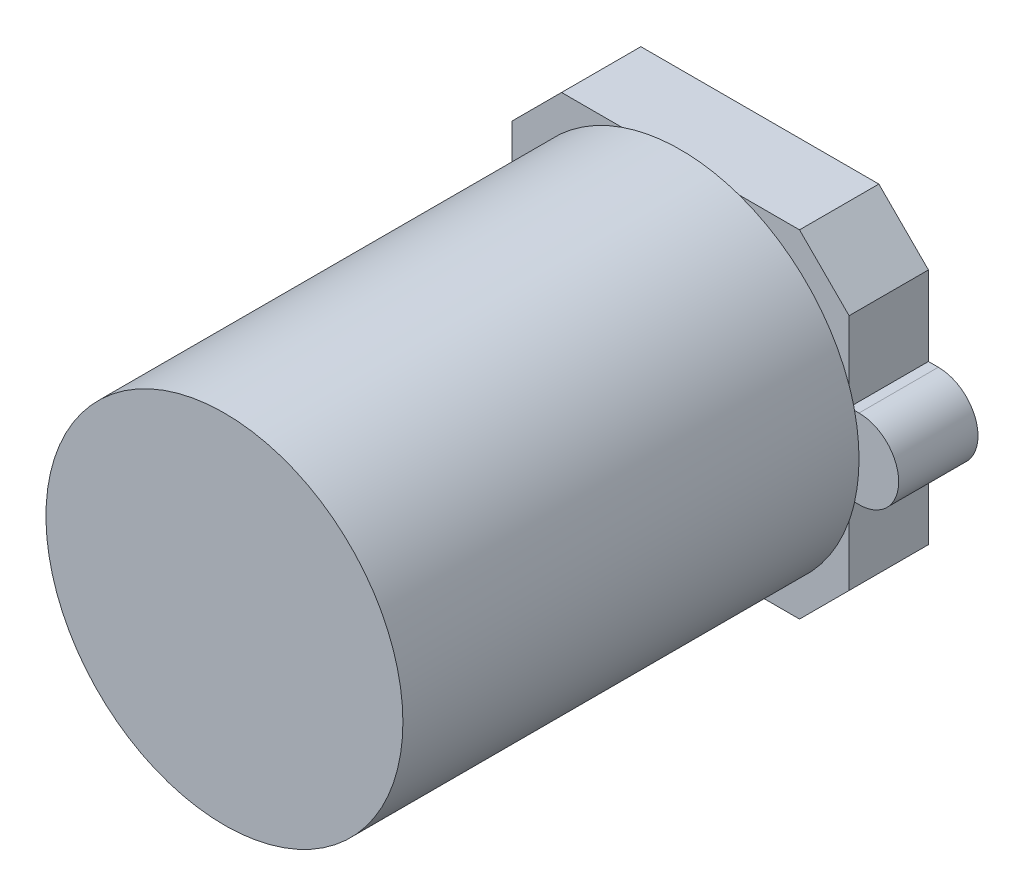
ISO-10303-21;
HEADER;
FILE_DESCRIPTION(('STEP AP214'),'2;1');
FILE_NAME('part.step','',(''),(''),'','','');
FILE_SCHEMA(('AUTOMOTIVE_DESIGN { 1 0 10303 214 1 1 1 1 }'));
ENDSEC;
DATA;
#1=APPLICATION_CONTEXT('core data for automotive mechanical design processes');
#2=APPLICATION_PROTOCOL_DEFINITION('international standard','automotive_design',2000,#1);
#3=PRODUCT_CONTEXT('',#1,'mechanical');
#4=PRODUCT('Part','Part','',(#3));
#5=PRODUCT_RELATED_PRODUCT_CATEGORY('part','',(#4));
#6=PRODUCT_DEFINITION_FORMATION('','',#4);
#7=PRODUCT_DEFINITION_CONTEXT('part definition',#1,'design');
#8=PRODUCT_DEFINITION('design','',#6,#7);
#9=PRODUCT_DEFINITION_SHAPE('','',#8);
#10=(LENGTH_UNIT() NAMED_UNIT(*) SI_UNIT(.MILLI.,.METRE.));
#11=(NAMED_UNIT(*) PLANE_ANGLE_UNIT() SI_UNIT($,.RADIAN.));
#12=(NAMED_UNIT(*) SI_UNIT($,.STERADIAN.) SOLID_ANGLE_UNIT());
#13=UNCERTAINTY_MEASURE_WITH_UNIT(LENGTH_MEASURE(1.E-05),#10,'distance_accuracy_value','');
#14=(GEOMETRIC_REPRESENTATION_CONTEXT(3) GLOBAL_UNCERTAINTY_ASSIGNED_CONTEXT((#13)) GLOBAL_UNIT_ASSIGNED_CONTEXT((#10,
#11,#12)) REPRESENTATION_CONTEXT('',''));
#15=CARTESIAN_POINT('',(0.,0.,0.));
#16=DIRECTION('',(0.,0.,1.));
#17=DIRECTION('',(1.,0.,0.));
#18=AXIS2_PLACEMENT_3D('',#15,#16,#17);
#19=CARTESIAN_POINT('',(0.,0.,4.));
#20=DIRECTION('',(0.,0.,-1.));
#21=DIRECTION('',(-1.,0.,0.));
#22=AXIS2_PLACEMENT_3D('',#19,#20,#21);
#23=PLANE('',#22);
#24=CARTESIAN_POINT('',(0.,0.,4.));
#25=DIRECTION('',(0.,0.,1.));
#26=DIRECTION('',(1.,0.,0.));
#27=AXIS2_PLACEMENT_3D('',#24,#25,#26);
#28=CIRCLE('',#27,9.);
#29=CARTESIAN_POINT('',(8.5,2.95803989154981,4.));
#30=VERTEX_POINT('',#29);
#31=CARTESIAN_POINT('',(2.95803989154981,8.5,4.));
#32=VERTEX_POINT('',#31);
#33=EDGE_CURVE('E11',#30,#32,#28,.T.);
#34=ORIENTED_EDGE('',*,*,#33,.F.);
#35=DIRECTION('',(0.,1.,0.));
#36=VECTOR('',#35,1.);
#37=CARTESIAN_POINT('',(8.5,-8.5,4.));
#38=LINE('',#37,#36);
#39=CARTESIAN_POINT('',(8.5,5.99999999999999,4.));
#40=VERTEX_POINT('',#39);
#41=EDGE_CURVE('E426',#30,#40,#38,.T.);
#42=ORIENTED_EDGE('',*,*,#41,.T.);
#43=DIRECTION('',(0.707106781186546,-0.707106781186549,0.));
#44=VECTOR('',#43,1.);
#45=CARTESIAN_POINT('',(6.,8.5,4.));
#46=LINE('',#45,#44);
#47=CARTESIAN_POINT('',(6.,8.5,4.));
#48=VERTEX_POINT('',#47);
#49=EDGE_CURVE('E304',#40,#48,#46,.F.);
#50=ORIENTED_EDGE('',*,*,#49,.T.);
#51=DIRECTION('',(-1.,0.,0.));
#52=VECTOR('',#51,1.);
#53=CARTESIAN_POINT('',(-8.5,8.5,4.));
#54=LINE('',#53,#52);
#55=EDGE_CURVE('E347',#48,#32,#54,.T.);
#56=ORIENTED_EDGE('',*,*,#55,.T.);
#57=EDGE_LOOP('',(#34,#42,#50,#56));
#58=FACE_BOUND('',#57,.T.);
#59=ADVANCED_FACE('F32',(#58),#23,.F.);
#60=CARTESIAN_POINT('',(-2.95803989154981,8.5,4.));
#61=VERTEX_POINT('',#60);
#62=CARTESIAN_POINT('',(-8.5,2.9580398915498,4.));
#63=VERTEX_POINT('',#62);
#64=EDGE_CURVE('E42',#61,#63,#28,.T.);
#65=ORIENTED_EDGE('',*,*,#64,.F.);
#66=CARTESIAN_POINT('',(-6.,8.5,4.));
#67=VERTEX_POINT('',#66);
#68=EDGE_CURVE('E354',#61,#67,#54,.T.);
#69=ORIENTED_EDGE('',*,*,#68,.T.);
#70=DIRECTION('',(0.707106781186549,0.707106781186546,0.));
#71=VECTOR('',#70,1.);
#72=CARTESIAN_POINT('',(-8.5,6.,4.));
#73=LINE('',#72,#71);
#74=CARTESIAN_POINT('',(-8.5,6.,4.));
#75=VERTEX_POINT('',#74);
#76=EDGE_CURVE('E310',#67,#75,#73,.F.);
#77=ORIENTED_EDGE('',*,*,#76,.T.);
#78=DIRECTION('',(0.,-1.,0.));
#79=VECTOR('',#78,1.);
#80=CARTESIAN_POINT('',(-8.5,-8.5,4.));
#81=LINE('',#80,#79);
#82=EDGE_CURVE('E338',#75,#63,#81,.T.);
#83=ORIENTED_EDGE('',*,*,#82,.T.);
#84=EDGE_LOOP('',(#65,#69,#77,#83));
#85=FACE_BOUND('',#84,.T.);
#86=ADVANCED_FACE('F498',(#85),#23,.F.);
#87=CARTESIAN_POINT('',(-8.77496438739212,2.,4.));
#88=VERTEX_POINT('',#87);
#89=CARTESIAN_POINT('',(-8.77496438739212,-2.,4.));
#90=VERTEX_POINT('',#89);
#91=EDGE_CURVE('E237',#88,#90,#28,.T.);
#92=ORIENTED_EDGE('',*,*,#91,.F.);
#93=DIRECTION('',(1.,0.,0.));
#94=VECTOR('',#93,1.);
#95=CARTESIAN_POINT('',(-8.5,2.,4.));
#96=LINE('',#95,#94);
#97=CARTESIAN_POINT('',(-9.,2.,4.));
#98=VERTEX_POINT('',#97);
#99=EDGE_CURVE('E247',#98,#88,#96,.T.);
#100=ORIENTED_EDGE('',*,*,#99,.F.);
#101=CARTESIAN_POINT('',(-9.,0.,4.));
#102=DIRECTION('',(0.,0.,-1.));
#103=DIRECTION('',(-1.,0.,0.));
#104=AXIS2_PLACEMENT_3D('',#101,#102,#103);
#105=CIRCLE('',#104,2.);
#106=CARTESIAN_POINT('',(-9.,-2.,4.));
#107=VERTEX_POINT('',#106);
#108=EDGE_CURVE('E248',#107,#98,#105,.T.);
#109=ORIENTED_EDGE('',*,*,#108,.F.);
#110=DIRECTION('',(-1.,0.,0.));
#111=VECTOR('',#110,1.);
#112=CARTESIAN_POINT('',(-9.,-2.,4.));
#113=LINE('',#112,#111);
#114=EDGE_CURVE('E258',#90,#107,#113,.T.);
#115=ORIENTED_EDGE('',*,*,#114,.F.);
#116=EDGE_LOOP('',(#92,#100,#109,#115));
#117=FACE_BOUND('',#116,.T.);
#118=ADVANCED_FACE('F503',(#117),#23,.F.);
#119=CARTESIAN_POINT('',(-8.5,-2.9580398915498,4.));
#120=VERTEX_POINT('',#119);
#121=CARTESIAN_POINT('',(-2.9580398915498,-8.5,4.));
#122=VERTEX_POINT('',#121);
#123=EDGE_CURVE('E488',#120,#122,#28,.T.);
#124=ORIENTED_EDGE('',*,*,#123,.F.);
#125=CARTESIAN_POINT('',(-8.5,-6.,4.));
#126=VERTEX_POINT('',#125);
#127=EDGE_CURVE('E36',#120,#126,#81,.T.);
#128=ORIENTED_EDGE('',*,*,#127,.T.);
#129=DIRECTION('',(-0.707106781186546,0.707106781186549,0.));
#130=VECTOR('',#129,1.);
#131=CARTESIAN_POINT('',(-6.00000000000001,-8.5,4.));
#132=LINE('',#131,#130);
#133=CARTESIAN_POINT('',(-6.00000000000001,-8.5,4.));
#134=VERTEX_POINT('',#133);
#135=EDGE_CURVE('E308',#126,#134,#132,.F.);
#136=ORIENTED_EDGE('',*,*,#135,.T.);
#137=DIRECTION('',(1.,0.,0.));
#138=VECTOR('',#137,1.);
#139=CARTESIAN_POINT('',(-8.5,-8.5,4.));
#140=LINE('',#139,#138);
#141=EDGE_CURVE('E277',#134,#122,#140,.T.);
#142=ORIENTED_EDGE('',*,*,#141,.T.);
#143=EDGE_LOOP('',(#124,#128,#136,#142));
#144=FACE_BOUND('',#143,.T.);
#145=ADVANCED_FACE('F487',(#144),#23,.F.);
#146=CARTESIAN_POINT('',(2.9580398915498,-8.5,4.));
#147=VERTEX_POINT('',#146);
#148=CARTESIAN_POINT('',(8.5,-2.95803989154981,4.));
#149=VERTEX_POINT('',#148);
#150=EDGE_CURVE('E51',#147,#149,#28,.T.);
#151=ORIENTED_EDGE('',*,*,#150,.F.);
#152=CARTESIAN_POINT('',(5.99999999999999,-8.5,4.));
#153=VERTEX_POINT('',#152);
#154=EDGE_CURVE('E336',#147,#153,#140,.T.);
#155=ORIENTED_EDGE('',*,*,#154,.T.);
#156=DIRECTION('',(-0.707106781186549,-0.707106781186546,0.));
#157=VECTOR('',#156,1.);
#158=CARTESIAN_POINT('',(8.5,-6.00000000000001,4.));
#159=LINE('',#158,#157);
#160=CARTESIAN_POINT('',(8.5,-6.00000000000001,4.));
#161=VERTEX_POINT('',#160);
#162=EDGE_CURVE('E306',#153,#161,#159,.F.);
#163=ORIENTED_EDGE('',*,*,#162,.T.);
#164=EDGE_CURVE('E364',#161,#149,#38,.T.);
#165=ORIENTED_EDGE('',*,*,#164,.T.);
#166=EDGE_LOOP('',(#151,#155,#163,#165));
#167=FACE_BOUND('',#166,.T.);
#168=ADVANCED_FACE('F428',(#167),#23,.F.);
#169=CARTESIAN_POINT('',(8.77496438739212,-2.,4.));
#170=VERTEX_POINT('',#169);
#171=CARTESIAN_POINT('',(8.77496438739212,2.,4.));
#172=VERTEX_POINT('',#171);
#173=EDGE_CURVE('E190',#170,#172,#28,.T.);
#174=ORIENTED_EDGE('',*,*,#173,.F.);
#175=DIRECTION('',(1.,0.,0.));
#176=VECTOR('',#175,1.);
#177=CARTESIAN_POINT('',(9.,-2.,4.));
#178=LINE('',#177,#176);
#179=CARTESIAN_POINT('',(9.,-2.,4.));
#180=VERTEX_POINT('',#179);
#181=EDGE_CURVE('E372',#170,#180,#178,.T.);
#182=ORIENTED_EDGE('',*,*,#181,.T.);
#183=CARTESIAN_POINT('',(9.,0.,4.));
#184=DIRECTION('',(0.,0.,-1.));
#185=DIRECTION('',(-1.,0.,0.));
#186=AXIS2_PLACEMENT_3D('',#183,#184,#185);
#187=CIRCLE('',#186,2.);
#188=CARTESIAN_POINT('',(9.,2.,4.));
#189=VERTEX_POINT('',#188);
#190=EDGE_CURVE('E193',#180,#189,#187,.F.);
#191=ORIENTED_EDGE('',*,*,#190,.T.);
#192=DIRECTION('',(-1.,0.,0.));
#193=VECTOR('',#192,1.);
#194=CARTESIAN_POINT('',(8.5,2.,4.));
#195=LINE('',#194,#193);
#196=EDGE_CURVE('E186',#189,#172,#195,.T.);
#197=ORIENTED_EDGE('',*,*,#196,.T.);
#198=EDGE_LOOP('',(#174,#182,#191,#197));
#199=FACE_BOUND('',#198,.T.);
#200=ADVANCED_FACE('F188',(#199),#23,.F.);
#201=CARTESIAN_POINT('',(8.5,-8.5,4.));
#202=DIRECTION('',(-1.,0.,0.));
#203=DIRECTION('',(0.,0.,1.));
#204=AXIS2_PLACEMENT_3D('',#201,#202,#203);
#205=PLANE('',#204);
#206=DIRECTION('',(0.,0.,-1.));
#207=VECTOR('',#206,1.);
#208=CARTESIAN_POINT('',(8.5,-2.,8.7169905660283));
#209=LINE('',#208,#207);
#210=CARTESIAN_POINT('',(8.5,-2.,4.));
#211=VERTEX_POINT('',#210);
#212=CARTESIAN_POINT('',(8.5,-2.,0.));
#213=VERTEX_POINT('',#212);
#214=EDGE_CURVE('E392',#211,#213,#209,.T.);
#215=ORIENTED_EDGE('',*,*,#214,.F.);
#216=EDGE_CURVE('E366',#149,#211,#38,.T.);
#217=ORIENTED_EDGE('',*,*,#216,.F.);
#218=ORIENTED_EDGE('',*,*,#164,.F.);
#219=DIRECTION('',(0.,0.,-1.));
#220=VECTOR('',#219,1.);
#221=CARTESIAN_POINT('',(8.5,-6.00000000000001,4.));
#222=LINE('',#221,#220);
#223=CARTESIAN_POINT('',(8.5,-6.00000000000001,0.));
#224=VERTEX_POINT('',#223);
#225=EDGE_CURVE('E315',#161,#224,#222,.T.);
#226=ORIENTED_EDGE('',*,*,#225,.T.);
#227=DIRECTION('',(0.,1.,0.));
#228=VECTOR('',#227,1.);
#229=CARTESIAN_POINT('',(8.5,-8.5,0.));
#230=LINE('',#229,#228);
#231=EDGE_CURVE('E269',#224,#213,#230,.T.);
#232=ORIENTED_EDGE('',*,*,#231,.T.);
#233=EDGE_LOOP('',(#215,#217,#218,#226,#232));
#234=FACE_BOUND('',#233,.T.);
#235=ADVANCED_FACE('F416',(#234),#205,.F.);
#236=CARTESIAN_POINT('',(-8.5,-8.5,4.));
#237=DIRECTION('',(1.,0.,0.));
#238=DIRECTION('',(0.,0.,-1.));
#239=AXIS2_PLACEMENT_3D('',#236,#237,#238);
#240=PLANE('',#239);
#241=DIRECTION('',(0.,0.,-1.));
#242=VECTOR('',#241,1.);
#243=CARTESIAN_POINT('',(-8.5,2.,8.7169905660283));
#244=LINE('',#243,#242);
#245=CARTESIAN_POINT('',(-8.5,2.,4.));
#246=VERTEX_POINT('',#245);
#247=CARTESIAN_POINT('',(-8.5,2.,0.));
#248=VERTEX_POINT('',#247);
#249=EDGE_CURVE('E450',#246,#248,#244,.T.);
#250=ORIENTED_EDGE('',*,*,#249,.F.);
#251=EDGE_CURVE('E242',#63,#246,#81,.T.);
#252=ORIENTED_EDGE('',*,*,#251,.F.);
#253=ORIENTED_EDGE('',*,*,#82,.F.);
#254=DIRECTION('',(0.,0.,-1.));
#255=VECTOR('',#254,1.);
#256=CARTESIAN_POINT('',(-8.5,6.,4.));
#257=LINE('',#256,#255);
#258=CARTESIAN_POINT('',(-8.5,6.00000000000001,0.));
#259=VERTEX_POINT('',#258);
#260=EDGE_CURVE('E295',#75,#259,#257,.T.);
#261=ORIENTED_EDGE('',*,*,#260,.T.);
#262=DIRECTION('',(0.,-1.,0.));
#263=VECTOR('',#262,1.);
#264=CARTESIAN_POINT('',(-8.5,-8.5,0.));
#265=LINE('',#264,#263);
#266=EDGE_CURVE('E290',#259,#248,#265,.T.);
#267=ORIENTED_EDGE('',*,*,#266,.T.);
#268=EDGE_LOOP('',(#250,#252,#253,#261,#267));
#269=FACE_BOUND('',#268,.T.);
#270=ADVANCED_FACE('F449',(#269),#240,.F.);
#271=CARTESIAN_POINT('',(8.5,2.,4.));
#272=VERTEX_POINT('',#271);
#273=EDGE_CURVE('E218',#272,#30,#38,.T.);
#274=ORIENTED_EDGE('',*,*,#273,.F.);
#275=DIRECTION('',(0.,0.,-1.));
#276=VECTOR('',#275,1.);
#277=CARTESIAN_POINT('',(8.5,2.,8.7169905660283));
#278=LINE('',#277,#276);
#279=CARTESIAN_POINT('',(8.5,2.,0.));
#280=VERTEX_POINT('',#279);
#281=EDGE_CURVE('E203',#272,#280,#278,.T.);
#282=ORIENTED_EDGE('',*,*,#281,.T.);
#283=CARTESIAN_POINT('',(8.5,5.99999999999999,0.));
#284=VERTEX_POINT('',#283);
#285=EDGE_CURVE('E250',#280,#284,#230,.T.);
#286=ORIENTED_EDGE('',*,*,#285,.T.);
#287=DIRECTION('',(0.,0.,1.));
#288=VECTOR('',#287,1.);
#289=CARTESIAN_POINT('',(8.5,5.99999999999999,4.));
#290=LINE('',#289,#288);
#291=EDGE_CURVE('E312',#284,#40,#290,.T.);
#292=ORIENTED_EDGE('',*,*,#291,.T.);
#293=ORIENTED_EDGE('',*,*,#41,.F.);
#294=EDGE_LOOP('',(#274,#282,#286,#292,#293));
#295=FACE_BOUND('',#294,.T.);
#296=ADVANCED_FACE('F437',(#295),#205,.F.);
#297=CARTESIAN_POINT('',(-8.5,8.5,4.));
#298=DIRECTION('',(0.,-1.,0.));
#299=DIRECTION('',(0.,0.,-1.));
#300=AXIS2_PLACEMENT_3D('',#297,#298,#299);
#301=PLANE('',#300);
#302=ORIENTED_EDGE('',*,*,#55,.F.);
#303=DIRECTION('',(0.,0.,-1.));
#304=VECTOR('',#303,1.);
#305=CARTESIAN_POINT('',(6.,8.5,4.));
#306=LINE('',#305,#304);
#307=CARTESIAN_POINT('',(6.00000000000001,8.5,0.));
#308=VERTEX_POINT('',#307);
#309=EDGE_CURVE('E328',#48,#308,#306,.T.);
#310=ORIENTED_EDGE('',*,*,#309,.T.);
#311=DIRECTION('',(-1.,0.,0.));
#312=VECTOR('',#311,1.);
#313=CARTESIAN_POINT('',(-8.5,8.5,0.));
#314=LINE('',#313,#312);
#315=CARTESIAN_POINT('',(-6.,8.5,0.));
#316=VERTEX_POINT('',#315);
#317=EDGE_CURVE('E272',#308,#316,#314,.T.);
#318=ORIENTED_EDGE('',*,*,#317,.T.);
#319=DIRECTION('',(0.,0.,1.));
#320=VECTOR('',#319,1.);
#321=CARTESIAN_POINT('',(-6.,8.5,4.));
#322=LINE('',#321,#320);
#323=EDGE_CURVE('E330',#316,#67,#322,.T.);
#324=ORIENTED_EDGE('',*,*,#323,.T.);
#325=ORIENTED_EDGE('',*,*,#68,.F.);
#326=EDGE_CURVE('E353',#32,#61,#54,.T.);
#327=ORIENTED_EDGE('',*,*,#326,.F.);
#328=EDGE_LOOP('',(#302,#310,#318,#324,#325,#327));
#329=FACE_BOUND('',#328,.T.);
#330=ADVANCED_FACE('F443',(#329),#301,.F.);
#331=CARTESIAN_POINT('',(-8.5,-2.,4.));
#332=VERTEX_POINT('',#331);
#333=EDGE_CURVE('E342',#332,#120,#81,.T.);
#334=ORIENTED_EDGE('',*,*,#333,.F.);
#335=DIRECTION('',(0.,0.,-1.));
#336=VECTOR('',#335,1.);
#337=CARTESIAN_POINT('',(-8.5,-2.,8.7169905660283));
#338=LINE('',#337,#336);
#339=CARTESIAN_POINT('',(-8.5,-2.,0.));
#340=VERTEX_POINT('',#339);
#341=EDGE_CURVE('E458',#332,#340,#338,.T.);
#342=ORIENTED_EDGE('',*,*,#341,.T.);
#343=CARTESIAN_POINT('',(-8.5,-6.,0.));
#344=VERTEX_POINT('',#343);
#345=EDGE_CURVE('E281',#340,#344,#265,.T.);
#346=ORIENTED_EDGE('',*,*,#345,.T.);
#347=DIRECTION('',(0.,0.,1.));
#348=VECTOR('',#347,1.);
#349=CARTESIAN_POINT('',(-8.5,-6.,4.));
#350=LINE('',#349,#348);
#351=EDGE_CURVE('E216',#344,#126,#350,.T.);
#352=ORIENTED_EDGE('',*,*,#351,.T.);
#353=ORIENTED_EDGE('',*,*,#127,.F.);
#354=EDGE_LOOP('',(#334,#342,#346,#352,#353));
#355=FACE_BOUND('',#354,.T.);
#356=ADVANCED_FACE('F480',(#355),#240,.F.);
#357=CARTESIAN_POINT('',(-8.5,-8.5,4.));
#358=DIRECTION('',(0.,1.,0.));
#359=DIRECTION('',(0.,0.,1.));
#360=AXIS2_PLACEMENT_3D('',#357,#358,#359);
#361=PLANE('',#360);
#362=DIRECTION('',(1.,0.,0.));
#363=VECTOR('',#362,1.);
#364=CARTESIAN_POINT('',(-8.5,-8.5,0.));
#365=LINE('',#364,#363);
#366=CARTESIAN_POINT('',(-6.00000000000001,-8.5,0.));
#367=VERTEX_POINT('',#366);
#368=CARTESIAN_POINT('',(5.99999999999999,-8.5,0.));
#369=VERTEX_POINT('',#368);
#370=EDGE_CURVE('E284',#367,#369,#365,.T.);
#371=ORIENTED_EDGE('',*,*,#370,.T.);
#372=DIRECTION('',(0.,0.,1.));
#373=VECTOR('',#372,1.);
#374=CARTESIAN_POINT('',(5.99999999999999,-8.5,4.));
#375=LINE('',#374,#373);
#376=EDGE_CURVE('E298',#369,#153,#375,.T.);
#377=ORIENTED_EDGE('',*,*,#376,.T.);
#378=ORIENTED_EDGE('',*,*,#154,.F.);
#379=EDGE_CURVE('E58',#122,#147,#140,.T.);
#380=ORIENTED_EDGE('',*,*,#379,.F.);
#381=ORIENTED_EDGE('',*,*,#141,.F.);
#382=DIRECTION('',(0.,0.,-1.));
#383=VECTOR('',#382,1.);
#384=CARTESIAN_POINT('',(-6.00000000000001,-8.5,4.));
#385=LINE('',#384,#383);
#386=EDGE_CURVE('E301',#134,#367,#385,.T.);
#387=ORIENTED_EDGE('',*,*,#386,.T.);
#388=EDGE_LOOP('',(#371,#377,#378,#380,#381,#387));
#389=FACE_BOUND('',#388,.T.);
#390=ADVANCED_FACE('F423',(#389),#361,.F.);
#391=CARTESIAN_POINT('',(0.,0.,0.));
#392=DIRECTION('',(0.,0.,-1.));
#393=DIRECTION('',(-1.,0.,0.));
#394=AXIS2_PLACEMENT_3D('',#391,#392,#393);
#395=PLANE('',#394);
#396=ORIENTED_EDGE('',*,*,#317,.F.);
#397=DIRECTION('',(-0.707106781186546,0.707106781186549,0.));
#398=VECTOR('',#397,1.);
#399=CARTESIAN_POINT('',(7.25000000000001,7.24999999999998,0.));
#400=LINE('',#399,#398);
#401=EDGE_CURVE('E318',#308,#284,#400,.F.);
#402=ORIENTED_EDGE('',*,*,#401,.T.);
#403=ORIENTED_EDGE('',*,*,#285,.F.);
#404=DIRECTION('',(1.,0.,0.));
#405=VECTOR('',#404,1.);
#406=CARTESIAN_POINT('',(8.5,2.,0.));
#407=LINE('',#406,#405);
#408=CARTESIAN_POINT('',(9.,2.,0.));
#409=VERTEX_POINT('',#408);
#410=EDGE_CURVE('E384',#280,#409,#407,.T.);
#411=ORIENTED_EDGE('',*,*,#410,.T.);
#412=CARTESIAN_POINT('',(9.,0.,0.));
#413=DIRECTION('',(0.,0.,-1.));
#414=DIRECTION('',(-1.,0.,0.));
#415=AXIS2_PLACEMENT_3D('',#412,#413,#414);
#416=CIRCLE('',#415,2.);
#417=CARTESIAN_POINT('',(9.,-2.,0.));
#418=VERTEX_POINT('',#417);
#419=EDGE_CURVE('E388',#409,#418,#416,.T.);
#420=ORIENTED_EDGE('',*,*,#419,.T.);
#421=DIRECTION('',(-1.,0.,0.));
#422=VECTOR('',#421,1.);
#423=CARTESIAN_POINT('',(9.,-2.,0.));
#424=LINE('',#423,#422);
#425=EDGE_CURVE('E221',#418,#213,#424,.T.);
#426=ORIENTED_EDGE('',*,*,#425,.T.);
#427=ORIENTED_EDGE('',*,*,#231,.F.);
#428=DIRECTION('',(0.707106781186549,0.707106781186546,0.));
#429=VECTOR('',#428,1.);
#430=CARTESIAN_POINT('',(7.24999999999998,-7.25000000000002,0.));
#431=LINE('',#430,#429);
#432=EDGE_CURVE('E321',#224,#369,#431,.F.);
#433=ORIENTED_EDGE('',*,*,#432,.T.);
#434=ORIENTED_EDGE('',*,*,#370,.F.);
#435=DIRECTION('',(0.707106781186546,-0.707106781186549,0.));
#436=VECTOR('',#435,1.);
#437=CARTESIAN_POINT('',(-7.25000000000002,-7.24999999999999,0.));
#438=LINE('',#437,#436);
#439=EDGE_CURVE('E323',#367,#344,#438,.F.);
#440=ORIENTED_EDGE('',*,*,#439,.T.);
#441=ORIENTED_EDGE('',*,*,#345,.F.);
#442=DIRECTION('',(1.,0.,0.));
#443=VECTOR('',#442,1.);
#444=CARTESIAN_POINT('',(-9.,-2.,0.));
#445=LINE('',#444,#443);
#446=CARTESIAN_POINT('',(-9.,-2.,0.));
#447=VERTEX_POINT('',#446);
#448=EDGE_CURVE('E462',#447,#340,#445,.T.);
#449=ORIENTED_EDGE('',*,*,#448,.F.);
#450=CARTESIAN_POINT('',(-9.,0.,0.));
#451=DIRECTION('',(0.,0.,1.));
#452=DIRECTION('',(1.,0.,0.));
#453=AXIS2_PLACEMENT_3D('',#450,#451,#452);
#454=CIRCLE('',#453,2.);
#455=CARTESIAN_POINT('',(-9.,2.,0.));
#456=VERTEX_POINT('',#455);
#457=EDGE_CURVE('E266',#456,#447,#454,.T.);
#458=ORIENTED_EDGE('',*,*,#457,.F.);
#459=DIRECTION('',(-1.,0.,0.));
#460=VECTOR('',#459,1.);
#461=CARTESIAN_POINT('',(-8.5,2.,0.));
#462=LINE('',#461,#460);
#463=EDGE_CURVE('E196',#248,#456,#462,.T.);
#464=ORIENTED_EDGE('',*,*,#463,.F.);
#465=ORIENTED_EDGE('',*,*,#266,.F.);
#466=DIRECTION('',(-0.707106781186549,-0.707106781186546,0.));
#467=VECTOR('',#466,1.);
#468=CARTESIAN_POINT('',(-7.24999999999999,7.25000000000002,0.));
#469=LINE('',#468,#467);
#470=EDGE_CURVE('E326',#259,#316,#469,.F.);
#471=ORIENTED_EDGE('',*,*,#470,.T.);
#472=EDGE_LOOP('',(#396,#402,#403,#411,#420,#426,#427,#433,#434,#440,#441,#449,#458,#464,#465,#471));
#473=FACE_BOUND('',#472,.T.);
#474=ADVANCED_FACE('F407',(#473),#395,.T.);
#475=CARTESIAN_POINT('',(6.,8.5,4.));
#476=DIRECTION('',(-0.707106781186549,-0.707106781186546,0.));
#477=DIRECTION('',(0.,0.,-1.));
#478=AXIS2_PLACEMENT_3D('',#475,#476,#477);
#479=PLANE('',#478);
#480=ORIENTED_EDGE('',*,*,#49,.F.);
#481=ORIENTED_EDGE('',*,*,#291,.F.);
#482=ORIENTED_EDGE('',*,*,#401,.F.);
#483=ORIENTED_EDGE('',*,*,#309,.F.);
#484=EDGE_LOOP('',(#480,#481,#482,#483));
#485=FACE_BOUND('',#484,.T.);
#486=ADVANCED_FACE('F442',(#485),#479,.F.);
#487=CARTESIAN_POINT('',(8.5,-6.00000000000001,4.));
#488=DIRECTION('',(-0.707106781186546,0.707106781186549,0.));
#489=DIRECTION('',(0.,0.,-1.));
#490=AXIS2_PLACEMENT_3D('',#487,#488,#489);
#491=PLANE('',#490);
#492=ORIENTED_EDGE('',*,*,#162,.F.);
#493=ORIENTED_EDGE('',*,*,#376,.F.);
#494=ORIENTED_EDGE('',*,*,#432,.F.);
#495=ORIENTED_EDGE('',*,*,#225,.F.);
#496=EDGE_LOOP('',(#492,#493,#494,#495));
#497=FACE_BOUND('',#496,.T.);
#498=ADVANCED_FACE('F427',(#497),#491,.F.);
#499=CARTESIAN_POINT('',(-6.00000000000001,-8.5,4.));
#500=DIRECTION('',(0.707106781186549,0.707106781186546,0.));
#501=DIRECTION('',(0.,0.,-1.));
#502=AXIS2_PLACEMENT_3D('',#499,#500,#501);
#503=PLANE('',#502);
#504=ORIENTED_EDGE('',*,*,#135,.F.);
#505=ORIENTED_EDGE('',*,*,#351,.F.);
#506=ORIENTED_EDGE('',*,*,#439,.F.);
#507=ORIENTED_EDGE('',*,*,#386,.F.);
#508=EDGE_LOOP('',(#504,#505,#506,#507));
#509=FACE_BOUND('',#508,.T.);
#510=ADVANCED_FACE('F490',(#509),#503,.F.);
#511=CARTESIAN_POINT('',(-8.5,6.,4.));
#512=DIRECTION('',(0.707106781186546,-0.707106781186549,0.));
#513=DIRECTION('',(0.,0.,-1.));
#514=AXIS2_PLACEMENT_3D('',#511,#512,#513);
#515=PLANE('',#514);
#516=ORIENTED_EDGE('',*,*,#76,.F.);
#517=ORIENTED_EDGE('',*,*,#323,.F.);
#518=ORIENTED_EDGE('',*,*,#470,.F.);
#519=ORIENTED_EDGE('',*,*,#260,.F.);
#520=EDGE_LOOP('',(#516,#517,#518,#519));
#521=FACE_BOUND('',#520,.T.);
#522=ADVANCED_FACE('F34',(#521),#515,.F.);
#523=CARTESIAN_POINT('',(-9.,-2.,8.7169905660283));
#524=DIRECTION('',(0.,1.,0.));
#525=DIRECTION('',(-1.,0.,0.));
#526=AXIS2_PLACEMENT_3D('',#523,#524,#525);
#527=PLANE('',#526);
#528=ORIENTED_EDGE('',*,*,#341,.F.);
#529=EDGE_CURVE('E253',#332,#90,#113,.T.);
#530=ORIENTED_EDGE('',*,*,#529,.T.);
#531=ORIENTED_EDGE('',*,*,#114,.T.);
#532=DIRECTION('',(0.,0.,-1.));
#533=VECTOR('',#532,1.);
#534=CARTESIAN_POINT('',(-9.,-2.,8.7169905660283));
#535=LINE('',#534,#533);
#536=EDGE_CURVE('E452',#107,#447,#535,.T.);
#537=ORIENTED_EDGE('',*,*,#536,.T.);
#538=ORIENTED_EDGE('',*,*,#448,.T.);
#539=EDGE_LOOP('',(#528,#530,#531,#537,#538));
#540=FACE_BOUND('',#539,.T.);
#541=ADVANCED_FACE('F469',(#540),#527,.F.);
#542=CARTESIAN_POINT('',(-9.,0.,8.7169905660283));
#543=DIRECTION('',(0.,0.,-1.));
#544=DIRECTION('',(-1.,0.,0.));
#545=AXIS2_PLACEMENT_3D('',#542,#543,#544);
#546=CYLINDRICAL_SURFACE('',#545,2.);
#547=ORIENTED_EDGE('',*,*,#536,.F.);
#548=ORIENTED_EDGE('',*,*,#108,.T.);
#549=DIRECTION('',(0.,0.,-1.));
#550=VECTOR('',#549,1.);
#551=CARTESIAN_POINT('',(-9.,2.,8.7169905660283));
#552=LINE('',#551,#550);
#553=EDGE_CURVE('E451',#98,#456,#552,.T.);
#554=ORIENTED_EDGE('',*,*,#553,.T.);
#555=ORIENTED_EDGE('',*,*,#457,.T.);
#556=EDGE_LOOP('',(#547,#548,#554,#555));
#557=FACE_BOUND('',#556,.T.);
#558=ADVANCED_FACE('F474',(#557),#546,.T.);
#559=CARTESIAN_POINT('',(-8.5,2.,8.7169905660283));
#560=DIRECTION('',(0.,-1.,0.));
#561=DIRECTION('',(0.,0.,-1.));
#562=AXIS2_PLACEMENT_3D('',#559,#560,#561);
#563=PLANE('',#562);
#564=ORIENTED_EDGE('',*,*,#553,.F.);
#565=ORIENTED_EDGE('',*,*,#99,.T.);
#566=EDGE_CURVE('E243',#88,#246,#96,.T.);
#567=ORIENTED_EDGE('',*,*,#566,.T.);
#568=ORIENTED_EDGE('',*,*,#249,.T.);
#569=ORIENTED_EDGE('',*,*,#463,.T.);
#570=EDGE_LOOP('',(#564,#565,#567,#568,#569));
#571=FACE_BOUND('',#570,.T.);
#572=ADVANCED_FACE('F521',(#571),#563,.F.);
#573=CARTESIAN_POINT('',(9.,-2.,8.7169905660283));
#574=DIRECTION('',(0.,-1.,0.));
#575=DIRECTION('',(1.,0.,0.));
#576=AXIS2_PLACEMENT_3D('',#573,#574,#575);
#577=PLANE('',#576);
#578=EDGE_CURVE('E207',#211,#170,#178,.T.);
#579=ORIENTED_EDGE('',*,*,#578,.F.);
#580=ORIENTED_EDGE('',*,*,#214,.T.);
#581=ORIENTED_EDGE('',*,*,#425,.F.);
#582=DIRECTION('',(0.,0.,-1.));
#583=VECTOR('',#582,1.);
#584=CARTESIAN_POINT('',(9.,-2.,8.7169905660283));
#585=LINE('',#584,#583);
#586=EDGE_CURVE('E390',#180,#418,#585,.T.);
#587=ORIENTED_EDGE('',*,*,#586,.F.);
#588=ORIENTED_EDGE('',*,*,#181,.F.);
#589=EDGE_LOOP('',(#579,#580,#581,#587,#588));
#590=FACE_BOUND('',#589,.T.);
#591=ADVANCED_FACE('F413',(#590),#577,.T.);
#592=CARTESIAN_POINT('',(9.,0.,8.7169905660283));
#593=DIRECTION('',(0.,0.,-1.));
#594=DIRECTION('',(-1.,0.,0.));
#595=AXIS2_PLACEMENT_3D('',#592,#593,#594);
#596=CYLINDRICAL_SURFACE('',#595,2.);
#597=ORIENTED_EDGE('',*,*,#190,.F.);
#598=ORIENTED_EDGE('',*,*,#586,.T.);
#599=ORIENTED_EDGE('',*,*,#419,.F.);
#600=DIRECTION('',(0.,0.,-1.));
#601=VECTOR('',#600,1.);
#602=CARTESIAN_POINT('',(9.,2.,8.7169905660283));
#603=LINE('',#602,#601);
#604=EDGE_CURVE('E383',#189,#409,#603,.T.);
#605=ORIENTED_EDGE('',*,*,#604,.F.);
#606=EDGE_LOOP('',(#597,#598,#599,#605));
#607=FACE_BOUND('',#606,.T.);
#608=ADVANCED_FACE('F409',(#607),#596,.T.);
#609=CARTESIAN_POINT('',(8.5,2.,8.7169905660283));
#610=DIRECTION('',(0.,1.,0.));
#611=DIRECTION('',(0.,0.,1.));
#612=AXIS2_PLACEMENT_3D('',#609,#610,#611);
#613=PLANE('',#612);
#614=ORIENTED_EDGE('',*,*,#196,.F.);
#615=ORIENTED_EDGE('',*,*,#604,.T.);
#616=ORIENTED_EDGE('',*,*,#410,.F.);
#617=ORIENTED_EDGE('',*,*,#281,.F.);
#618=EDGE_CURVE('E197',#172,#272,#195,.T.);
#619=ORIENTED_EDGE('',*,*,#618,.F.);
#620=EDGE_LOOP('',(#614,#615,#616,#617,#619));
#621=FACE_BOUND('',#620,.T.);
#622=ADVANCED_FACE('F201',(#621),#613,.T.);
#623=CARTESIAN_POINT('',(0.,0.,4.));
#624=DIRECTION('',(0.,0.,1.));
#625=DIRECTION('',(1.,0.,0.));
#626=AXIS2_PLACEMENT_3D('',#623,#624,#625);
#627=PLANE('',#626);
#628=EDGE_CURVE('E215',#149,#170,#28,.T.);
#629=ORIENTED_EDGE('',*,*,#628,.F.);
#630=ORIENTED_EDGE('',*,*,#216,.T.);
#631=ORIENTED_EDGE('',*,*,#578,.T.);
#632=EDGE_LOOP('',(#629,#630,#631));
#633=FACE_BOUND('',#632,.T.);
#634=ADVANCED_FACE('F536',(#633),#627,.F.);
#635=EDGE_CURVE('E213',#172,#30,#28,.T.);
#636=ORIENTED_EDGE('',*,*,#635,.F.);
#637=ORIENTED_EDGE('',*,*,#618,.T.);
#638=ORIENTED_EDGE('',*,*,#273,.T.);
#639=EDGE_LOOP('',(#636,#637,#638));
#640=FACE_BOUND('',#639,.T.);
#641=ADVANCED_FACE('F217',(#640),#627,.F.);
#642=EDGE_CURVE('E44',#32,#61,#28,.T.);
#643=ORIENTED_EDGE('',*,*,#642,.F.);
#644=ORIENTED_EDGE('',*,*,#326,.T.);
#645=EDGE_LOOP('',(#643,#644));
#646=FACE_BOUND('',#645,.T.);
#647=ADVANCED_FACE('F432',(#646),#627,.F.);
#648=EDGE_CURVE('E224',#63,#88,#28,.T.);
#649=ORIENTED_EDGE('',*,*,#648,.F.);
#650=ORIENTED_EDGE('',*,*,#251,.T.);
#651=ORIENTED_EDGE('',*,*,#566,.F.);
#652=EDGE_LOOP('',(#649,#650,#651));
#653=FACE_BOUND('',#652,.T.);
#654=ADVANCED_FACE('F241',(#653),#627,.F.);
#655=EDGE_CURVE('E226',#122,#147,#28,.T.);
#656=ORIENTED_EDGE('',*,*,#655,.F.);
#657=ORIENTED_EDGE('',*,*,#379,.T.);
#658=EDGE_LOOP('',(#656,#657));
#659=FACE_BOUND('',#658,.T.);
#660=ADVANCED_FACE('F540',(#659),#627,.F.);
#661=CARTESIAN_POINT('',(0.,0.,27.));
#662=DIRECTION('',(0.,0.,-1.));
#663=DIRECTION('',(-1.,0.,0.));
#664=AXIS2_PLACEMENT_3D('',#661,#662,#663);
#665=CYLINDRICAL_SURFACE('',#664,9.);
#666=CARTESIAN_POINT('',(0.,0.,27.));
#667=DIRECTION('',(0.,0.,1.));
#668=DIRECTION('',(1.,0.,0.));
#669=AXIS2_PLACEMENT_3D('',#666,#667,#668);
#670=CIRCLE('',#669,9.);
#671=CARTESIAN_POINT('',(9.,0.,27.));
#672=VERTEX_POINT('',#671);
#673=EDGE_CURVE('E219',#672,#672,#670,.T.);
#674=ORIENTED_EDGE('',*,*,#673,.F.);
#675=EDGE_LOOP('',(#674));
#676=FACE_BOUND('',#675,.T.);
#677=ORIENTED_EDGE('',*,*,#635,.T.);
#678=ORIENTED_EDGE('',*,*,#33,.T.);
#679=ORIENTED_EDGE('',*,*,#642,.T.);
#680=ORIENTED_EDGE('',*,*,#64,.T.);
#681=ORIENTED_EDGE('',*,*,#648,.T.);
#682=ORIENTED_EDGE('',*,*,#91,.T.);
#683=EDGE_CURVE('E228',#90,#120,#28,.T.);
#684=ORIENTED_EDGE('',*,*,#683,.T.);
#685=ORIENTED_EDGE('',*,*,#123,.T.);
#686=ORIENTED_EDGE('',*,*,#655,.T.);
#687=ORIENTED_EDGE('',*,*,#150,.T.);
#688=ORIENTED_EDGE('',*,*,#628,.T.);
#689=ORIENTED_EDGE('',*,*,#173,.T.);
#690=EDGE_LOOP('',(#677,#678,#679,#680,#681,#682,#684,#685,#686,#687,#688,#689));
#691=FACE_BOUND('',#690,.T.);
#692=ADVANCED_FACE('F212',(#676,#691),#665,.T.);
#693=CARTESIAN_POINT('',(0.,0.,27.));
#694=DIRECTION('',(0.,0.,1.));
#695=DIRECTION('',(1.,0.,0.));
#696=AXIS2_PLACEMENT_3D('',#693,#694,#695);
#697=PLANE('',#696);
#698=ORIENTED_EDGE('',*,*,#673,.T.);
#699=EDGE_LOOP('',(#698));
#700=FACE_BOUND('',#699,.T.);
#701=ADVANCED_FACE('F539',(#700),#697,.T.);
#702=ORIENTED_EDGE('',*,*,#529,.F.);
#703=ORIENTED_EDGE('',*,*,#333,.T.);
#704=ORIENTED_EDGE('',*,*,#683,.F.);
#705=EDGE_LOOP('',(#702,#703,#704));
#706=FACE_BOUND('',#705,.T.);
#707=ADVANCED_FACE('F486',(#706),#627,.F.);
#708=CLOSED_SHELL('',(#59,#86,#118,#145,#168,#200,#235,#270,#296,#330,#356,#390,#474,#486,#498,
#510,#522,#541,#558,#572,#591,#608,#622,#634,#641,#647,#654,#660,#692,#701,#707));
#709=MANIFOLD_SOLID_BREP('B2',#708);
#710=ADVANCED_BREP_SHAPE_REPRESENTATION('',(#18,#709),#14);
#711=SHAPE_DEFINITION_REPRESENTATION(#9,#710);
ENDSEC;
END-ISO-10303-21;
